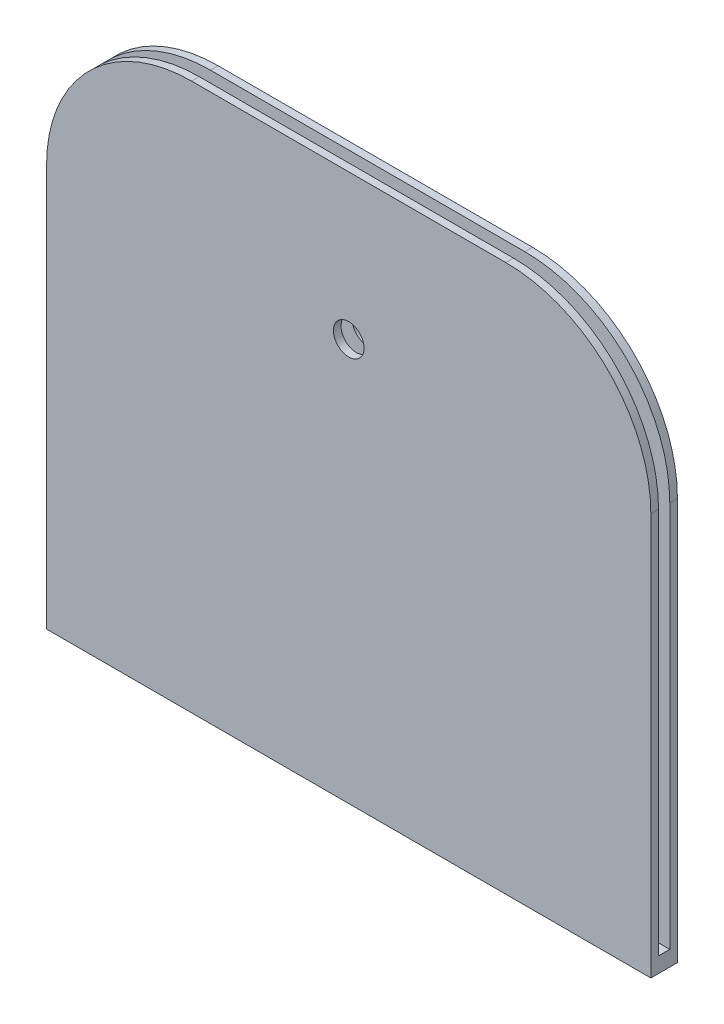
ISO-10303-21;
HEADER;
FILE_DESCRIPTION(('STEP AP214'),'2;1');
FILE_NAME('part.step','',(''),(''),'','','');
FILE_SCHEMA(('AUTOMOTIVE_DESIGN { 1 0 10303 214 1 1 1 1 }'));
ENDSEC;
DATA;
#1=APPLICATION_CONTEXT('core data for automotive mechanical design processes');
#2=APPLICATION_PROTOCOL_DEFINITION('international standard','automotive_design',2000,#1);
#3=PRODUCT_CONTEXT('',#1,'mechanical');
#4=PRODUCT('Part','Part','',(#3));
#5=PRODUCT_RELATED_PRODUCT_CATEGORY('part','',(#4));
#6=PRODUCT_DEFINITION_FORMATION('','',#4);
#7=PRODUCT_DEFINITION_CONTEXT('part definition',#1,'design');
#8=PRODUCT_DEFINITION('design','',#6,#7);
#9=PRODUCT_DEFINITION_SHAPE('','',#8);
#10=(LENGTH_UNIT() NAMED_UNIT(*) SI_UNIT(.MILLI.,.METRE.));
#11=(NAMED_UNIT(*) PLANE_ANGLE_UNIT() SI_UNIT($,.RADIAN.));
#12=(NAMED_UNIT(*) SI_UNIT($,.STERADIAN.) SOLID_ANGLE_UNIT());
#13=UNCERTAINTY_MEASURE_WITH_UNIT(LENGTH_MEASURE(1.E-05),#10,'distance_accuracy_value','');
#14=(GEOMETRIC_REPRESENTATION_CONTEXT(3) GLOBAL_UNCERTAINTY_ASSIGNED_CONTEXT((#13)) GLOBAL_UNIT_ASSIGNED_CONTEXT((#10,
#11,#12)) REPRESENTATION_CONTEXT('',''));
#15=CARTESIAN_POINT('',(0.,0.,0.));
#16=DIRECTION('',(0.,0.,1.));
#17=DIRECTION('',(1.,0.,0.));
#18=AXIS2_PLACEMENT_3D('',#15,#16,#17);
#19=CARTESIAN_POINT('',(0.,6.35,0.));
#20=DIRECTION('',(0.,1.,0.));
#21=DIRECTION('',(0.,0.,1.));
#22=AXIS2_PLACEMENT_3D('',#19,#20,#21);
#23=PLANE('',#22);
#24=DIRECTION('',(0.,0.,1.));
#25=VECTOR('',#24,1.);
#26=CARTESIAN_POINT('',(0.,6.35,-5.19119685893226));
#27=LINE('',#26,#25);
#28=CARTESIAN_POINT('',(0.,6.35,-2.01619685893224));
#29=VERTEX_POINT('',#28);
#30=CARTESIAN_POINT('',(0.,6.35,2.63380314106774));
#31=VERTEX_POINT('',#30);
#32=EDGE_CURVE('E128',#29,#31,#27,.T.);
#33=ORIENTED_EDGE('',*,*,#32,.T.);
#34=DIRECTION('',(-1.,0.,0.));
#35=VECTOR('',#34,1.);
#36=CARTESIAN_POINT('',(0.,6.35,2.63380314106774));
#37=LINE('',#36,#35);
#38=CARTESIAN_POINT('',(250.,6.35,2.63380314106774));
#39=VERTEX_POINT('',#38);
#40=EDGE_CURVE('E137',#39,#31,#37,.T.);
#41=ORIENTED_EDGE('',*,*,#40,.F.);
#42=DIRECTION('',(0.,0.,-1.));
#43=VECTOR('',#42,1.);
#44=CARTESIAN_POINT('',(250.,6.35,-5.19119685893226));
#45=LINE('',#44,#43);
#46=CARTESIAN_POINT('',(250.,6.35,-2.01619685893226));
#47=VERTEX_POINT('',#46);
#48=EDGE_CURVE('E150',#39,#47,#45,.T.);
#49=ORIENTED_EDGE('',*,*,#48,.T.);
#50=DIRECTION('',(1.,0.,0.));
#51=VECTOR('',#50,1.);
#52=CARTESIAN_POINT('',(250.,6.35,-2.01619685893226));
#53=LINE('',#52,#51);
#54=EDGE_CURVE('E149',#29,#47,#53,.T.);
#55=ORIENTED_EDGE('',*,*,#54,.F.);
#56=EDGE_LOOP('',(#33,#41,#49,#55));
#57=FACE_BOUND('',#56,.T.);
#58=ADVANCED_FACE('F37',(#57),#23,.T.);
#59=CARTESIAN_POINT('',(0.,6.35,-5.19119685893226));
#60=DIRECTION('',(1.,0.,0.));
#61=DIRECTION('',(0.,0.,-1.));
#62=AXIS2_PLACEMENT_3D('',#59,#60,#61);
#63=PLANE('',#62);
#64=DIRECTION('',(0.,-1.,0.));
#65=VECTOR('',#64,1.);
#66=CARTESIAN_POINT('',(0.,226.35,-2.01619685893223));
#67=LINE('',#66,#65);
#68=CARTESIAN_POINT('',(0.,166.35,-2.01619685893223));
#69=VERTEX_POINT('',#68);
#70=EDGE_CURVE('E159',#69,#29,#67,.T.);
#71=ORIENTED_EDGE('',*,*,#70,.F.);
#72=DIRECTION('',(0.,0.,1.));
#73=VECTOR('',#72,1.);
#74=CARTESIAN_POINT('',(0.,166.35,-5.19119685893226));
#75=LINE('',#74,#73);
#76=CARTESIAN_POINT('',(0.,166.35,-5.19119685893226));
#77=VERTEX_POINT('',#76);
#78=EDGE_CURVE('E11',#69,#77,#75,.F.);
#79=ORIENTED_EDGE('',*,*,#78,.T.);
#80=DIRECTION('',(0.,-1.,0.));
#81=VECTOR('',#80,1.);
#82=CARTESIAN_POINT('',(0.,6.35,-5.19119685893226));
#83=LINE('',#82,#81);
#84=CARTESIAN_POINT('',(0.,0.,-5.19119685893226));
#85=VERTEX_POINT('',#84);
#86=EDGE_CURVE('E153',#77,#85,#83,.T.);
#87=ORIENTED_EDGE('',*,*,#86,.T.);
#88=DIRECTION('',(0.,0.,1.));
#89=VECTOR('',#88,1.);
#90=CARTESIAN_POINT('',(0.,0.,-5.19119685893226));
#91=LINE('',#90,#89);
#92=CARTESIAN_POINT('',(0.,0.,5.80880314106774));
#93=VERTEX_POINT('',#92);
#94=EDGE_CURVE('E162',#85,#93,#91,.T.);
#95=ORIENTED_EDGE('',*,*,#94,.T.);
#96=DIRECTION('',(0.,-1.,0.));
#97=VECTOR('',#96,1.);
#98=CARTESIAN_POINT('',(0.,6.35,5.80880314106774));
#99=LINE('',#98,#97);
#100=CARTESIAN_POINT('',(0.,166.35,5.80880314106774));
#101=VERTEX_POINT('',#100);
#102=EDGE_CURVE('E175',#101,#93,#99,.T.);
#103=ORIENTED_EDGE('',*,*,#102,.F.);
#104=DIRECTION('',(0.,0.,1.));
#105=VECTOR('',#104,1.);
#106=CARTESIAN_POINT('',(0.,166.35,-5.19119685893226));
#107=LINE('',#106,#105);
#108=CARTESIAN_POINT('',(0.,166.35,2.63380314106774));
#109=VERTEX_POINT('',#108);
#110=EDGE_CURVE('E46',#101,#109,#107,.F.);
#111=ORIENTED_EDGE('',*,*,#110,.T.);
#112=DIRECTION('',(0.,-1.,0.));
#113=VECTOR('',#112,1.);
#114=CARTESIAN_POINT('',(0.,226.35,2.63380314106774));
#115=LINE('',#114,#113);
#116=EDGE_CURVE('E124',#109,#31,#115,.T.);
#117=ORIENTED_EDGE('',*,*,#116,.T.);
#118=ORIENTED_EDGE('',*,*,#32,.F.);
#119=EDGE_LOOP('',(#71,#79,#87,#95,#103,#111,#117,#118));
#120=FACE_BOUND('',#119,.T.);
#121=ADVANCED_FACE('F126',(#120),#63,.F.);
#122=CARTESIAN_POINT('',(0.,6.35,5.80880314106774));
#123=DIRECTION('',(0.,0.,-1.));
#124=DIRECTION('',(-1.,0.,0.));
#125=AXIS2_PLACEMENT_3D('',#122,#123,#124);
#126=PLANE('',#125);
#127=CARTESIAN_POINT('',(125.,166.35,5.80880314106774));
#128=DIRECTION('',(0.,0.,-1.));
#129=DIRECTION('',(-1.,0.,0.));
#130=AXIS2_PLACEMENT_3D('',#127,#128,#129);
#131=CIRCLE('',#130,6.34999999999999);
#132=CARTESIAN_POINT('',(118.65,166.35,5.80880314106774));
#133=VERTEX_POINT('',#132);
#134=EDGE_CURVE('E293',#133,#133,#131,.F.);
#135=ORIENTED_EDGE('',*,*,#134,.F.);
#136=EDGE_LOOP('',(#135));
#137=FACE_BOUND('',#136,.T.);
#138=DIRECTION('',(0.,-1.,0.));
#139=VECTOR('',#138,1.);
#140=CARTESIAN_POINT('',(250.,6.35,5.80880314106774));
#141=LINE('',#140,#139);
#142=CARTESIAN_POINT('',(250.,166.35,5.80880314106774));
#143=VERTEX_POINT('',#142);
#144=CARTESIAN_POINT('',(250.,0.,5.80880314106774));
#145=VERTEX_POINT('',#144);
#146=EDGE_CURVE('E173',#143,#145,#141,.T.);
#147=ORIENTED_EDGE('',*,*,#146,.F.);
#148=CARTESIAN_POINT('',(190.,166.35,5.80880314106774));
#149=DIRECTION('',(0.,0.,-1.));
#150=DIRECTION('',(-1.,0.,0.));
#151=AXIS2_PLACEMENT_3D('',#148,#149,#150);
#152=CIRCLE('',#151,60.);
#153=CARTESIAN_POINT('',(190.,226.35,5.80880314106774));
#154=VERTEX_POINT('',#153);
#155=EDGE_CURVE('E193',#143,#154,#152,.F.);
#156=ORIENTED_EDGE('',*,*,#155,.T.);
#157=DIRECTION('',(1.,0.,0.));
#158=VECTOR('',#157,1.);
#159=CARTESIAN_POINT('',(0.,226.35,5.80880314106774));
#160=LINE('',#159,#158);
#161=CARTESIAN_POINT('',(60.,226.35,5.80880314106774));
#162=VERTEX_POINT('',#161);
#163=EDGE_CURVE('E144',#162,#154,#160,.T.);
#164=ORIENTED_EDGE('',*,*,#163,.F.);
#165=CARTESIAN_POINT('',(60.,166.35,5.80880314106774));
#166=DIRECTION('',(0.,0.,-1.));
#167=DIRECTION('',(-1.,0.,0.));
#168=AXIS2_PLACEMENT_3D('',#165,#166,#167);
#169=CIRCLE('',#168,60.);
#170=EDGE_CURVE('E191',#162,#101,#169,.F.);
#171=ORIENTED_EDGE('',*,*,#170,.T.);
#172=ORIENTED_EDGE('',*,*,#102,.T.);
#173=DIRECTION('',(1.,0.,0.));
#174=VECTOR('',#173,1.);
#175=CARTESIAN_POINT('',(0.,0.,5.80880314106774));
#176=LINE('',#175,#174);
#177=EDGE_CURVE('E165',#93,#145,#176,.T.);
#178=ORIENTED_EDGE('',*,*,#177,.T.);
#179=EDGE_LOOP('',(#147,#156,#164,#171,#172,#178));
#180=FACE_BOUND('',#179,.T.);
#181=ADVANCED_FACE('F254',(#137,#180),#126,.F.);
#182=CARTESIAN_POINT('',(250.,6.35,-5.19119685893226));
#183=DIRECTION('',(-1.,0.,0.));
#184=DIRECTION('',(0.,0.,1.));
#185=AXIS2_PLACEMENT_3D('',#182,#183,#184);
#186=PLANE('',#185);
#187=DIRECTION('',(0.,-1.,0.));
#188=VECTOR('',#187,1.);
#189=CARTESIAN_POINT('',(250.,226.35,2.63380314106774));
#190=LINE('',#189,#188);
#191=CARTESIAN_POINT('',(250.,166.35,2.63380314106774));
#192=VERTEX_POINT('',#191);
#193=EDGE_CURVE('E133',#192,#39,#190,.T.);
#194=ORIENTED_EDGE('',*,*,#193,.F.);
#195=DIRECTION('',(0.,0.,-1.));
#196=VECTOR('',#195,1.);
#197=CARTESIAN_POINT('',(250.,166.35,-5.19119685893226));
#198=LINE('',#197,#196);
#199=EDGE_CURVE('E189',#192,#143,#198,.F.);
#200=ORIENTED_EDGE('',*,*,#199,.T.);
#201=ORIENTED_EDGE('',*,*,#146,.T.);
#202=DIRECTION('',(0.,0.,-1.));
#203=VECTOR('',#202,1.);
#204=CARTESIAN_POINT('',(250.,0.,-5.19119685893226));
#205=LINE('',#204,#203);
#206=CARTESIAN_POINT('',(250.,0.,-5.19119685893226));
#207=VERTEX_POINT('',#206);
#208=EDGE_CURVE('E156',#145,#207,#205,.T.);
#209=ORIENTED_EDGE('',*,*,#208,.T.);
#210=DIRECTION('',(0.,-1.,0.));
#211=VECTOR('',#210,1.);
#212=CARTESIAN_POINT('',(250.,6.35,-5.19119685893226));
#213=LINE('',#212,#211);
#214=CARTESIAN_POINT('',(250.,166.35,-5.19119685893226));
#215=VERTEX_POINT('',#214);
#216=EDGE_CURVE('E171',#215,#207,#213,.T.);
#217=ORIENTED_EDGE('',*,*,#216,.F.);
#218=DIRECTION('',(0.,0.,-1.));
#219=VECTOR('',#218,1.);
#220=CARTESIAN_POINT('',(250.,166.35,-5.19119685893226));
#221=LINE('',#220,#219);
#222=CARTESIAN_POINT('',(250.,166.35,-2.01619685893226));
#223=VERTEX_POINT('',#222);
#224=EDGE_CURVE('E187',#215,#223,#221,.F.);
#225=ORIENTED_EDGE('',*,*,#224,.T.);
#226=DIRECTION('',(0.,-1.,0.));
#227=VECTOR('',#226,1.);
#228=CARTESIAN_POINT('',(250.,226.35,-2.01619685893226));
#229=LINE('',#228,#227);
#230=EDGE_CURVE('E213',#223,#47,#229,.T.);
#231=ORIENTED_EDGE('',*,*,#230,.T.);
#232=ORIENTED_EDGE('',*,*,#48,.F.);
#233=EDGE_LOOP('',(#194,#200,#201,#209,#217,#225,#231,#232));
#234=FACE_BOUND('',#233,.T.);
#235=ADVANCED_FACE('F229',(#234),#186,.F.);
#236=CARTESIAN_POINT('',(0.,6.35,-5.19119685893226));
#237=DIRECTION('',(0.,0.,1.));
#238=DIRECTION('',(1.,0.,0.));
#239=AXIS2_PLACEMENT_3D('',#236,#237,#238);
#240=PLANE('',#239);
#241=CARTESIAN_POINT('',(125.,166.35,-5.19119685893226));
#242=DIRECTION('',(0.,0.,-1.));
#243=DIRECTION('',(-1.,0.,0.));
#244=AXIS2_PLACEMENT_3D('',#241,#242,#243);
#245=CIRCLE('',#244,6.34999999999999);
#246=CARTESIAN_POINT('',(118.65,166.35,-5.19119685893226));
#247=VERTEX_POINT('',#246);
#248=EDGE_CURVE('E296',#247,#247,#245,.T.);
#249=ORIENTED_EDGE('',*,*,#248,.F.);
#250=EDGE_LOOP('',(#249));
#251=FACE_BOUND('',#250,.T.);
#252=DIRECTION('',(-1.,0.,0.));
#253=VECTOR('',#252,1.);
#254=CARTESIAN_POINT('',(250.,226.35,-5.19119685893226));
#255=LINE('',#254,#253);
#256=CARTESIAN_POINT('',(190.,226.35,-5.19119685893226));
#257=VERTEX_POINT('',#256);
#258=CARTESIAN_POINT('',(60.,226.35,-5.19119685893226));
#259=VERTEX_POINT('',#258);
#260=EDGE_CURVE('E222',#257,#259,#255,.T.);
#261=ORIENTED_EDGE('',*,*,#260,.F.);
#262=CARTESIAN_POINT('',(190.,166.35,-5.19119685893226));
#263=DIRECTION('',(0.,0.,1.));
#264=DIRECTION('',(1.,0.,0.));
#265=AXIS2_PLACEMENT_3D('',#262,#263,#264);
#266=CIRCLE('',#265,60.);
#267=EDGE_CURVE('E203',#257,#215,#266,.F.);
#268=ORIENTED_EDGE('',*,*,#267,.T.);
#269=ORIENTED_EDGE('',*,*,#216,.T.);
#270=DIRECTION('',(-1.,0.,0.));
#271=VECTOR('',#270,1.);
#272=CARTESIAN_POINT('',(0.,0.,-5.19119685893226));
#273=LINE('',#272,#271);
#274=EDGE_CURVE('E151',#207,#85,#273,.T.);
#275=ORIENTED_EDGE('',*,*,#274,.T.);
#276=ORIENTED_EDGE('',*,*,#86,.F.);
#277=CARTESIAN_POINT('',(60.,166.35,-5.19119685893226));
#278=DIRECTION('',(0.,0.,1.));
#279=DIRECTION('',(1.,0.,0.));
#280=AXIS2_PLACEMENT_3D('',#277,#278,#279);
#281=CIRCLE('',#280,60.);
#282=EDGE_CURVE('E201',#77,#259,#281,.F.);
#283=ORIENTED_EDGE('',*,*,#282,.T.);
#284=EDGE_LOOP('',(#261,#268,#269,#275,#276,#283));
#285=FACE_BOUND('',#284,.T.);
#286=ADVANCED_FACE('F227',(#251,#285),#240,.F.);
#287=CARTESIAN_POINT('',(0.,0.,0.));
#288=DIRECTION('',(0.,1.,0.));
#289=DIRECTION('',(0.,0.,1.));
#290=AXIS2_PLACEMENT_3D('',#287,#288,#289);
#291=PLANE('',#290);
#292=ORIENTED_EDGE('',*,*,#94,.F.);
#293=ORIENTED_EDGE('',*,*,#274,.F.);
#294=ORIENTED_EDGE('',*,*,#208,.F.);
#295=ORIENTED_EDGE('',*,*,#177,.F.);
#296=EDGE_LOOP('',(#292,#293,#294,#295));
#297=FACE_BOUND('',#296,.T.);
#298=ADVANCED_FACE('F236',(#297),#291,.F.);
#299=CARTESIAN_POINT('',(250.,226.35,-2.01619685893226));
#300=DIRECTION('',(0.,0.,-1.));
#301=DIRECTION('',(-1.,0.,0.));
#302=AXIS2_PLACEMENT_3D('',#299,#300,#301);
#303=PLANE('',#302);
#304=CARTESIAN_POINT('',(125.,166.35,-2.01619685893224));
#305=DIRECTION('',(0.,0.,-1.));
#306=DIRECTION('',(-1.,0.,0.));
#307=AXIS2_PLACEMENT_3D('',#304,#305,#306);
#308=CIRCLE('',#307,6.34999999999999);
#309=CARTESIAN_POINT('',(118.65,166.35,-2.01619685893224));
#310=VERTEX_POINT('',#309);
#311=EDGE_CURVE('E145',#310,#310,#308,.T.);
#312=ORIENTED_EDGE('',*,*,#311,.T.);
#313=EDGE_LOOP('',(#312));
#314=FACE_BOUND('',#313,.T.);
#315=ORIENTED_EDGE('',*,*,#230,.F.);
#316=CARTESIAN_POINT('',(190.,166.35,-2.01619685893225));
#317=DIRECTION('',(0.,0.,-1.));
#318=DIRECTION('',(-1.,0.,0.));
#319=AXIS2_PLACEMENT_3D('',#316,#317,#318);
#320=CIRCLE('',#319,60.);
#321=CARTESIAN_POINT('',(190.,226.35,-2.01619685893225));
#322=VERTEX_POINT('',#321);
#323=EDGE_CURVE('E206',#223,#322,#320,.F.);
#324=ORIENTED_EDGE('',*,*,#323,.T.);
#325=DIRECTION('',(1.,0.,0.));
#326=VECTOR('',#325,1.);
#327=CARTESIAN_POINT('',(250.,226.35,-2.01619685893226));
#328=LINE('',#327,#326);
#329=CARTESIAN_POINT('',(60.,226.35,-2.01619685893223));
#330=VERTEX_POINT('',#329);
#331=EDGE_CURVE('E212',#330,#322,#328,.T.);
#332=ORIENTED_EDGE('',*,*,#331,.F.);
#333=CARTESIAN_POINT('',(60.,166.35,-2.01619685893223));
#334=DIRECTION('',(0.,0.,-1.));
#335=DIRECTION('',(-1.,0.,0.));
#336=AXIS2_PLACEMENT_3D('',#333,#334,#335);
#337=CIRCLE('',#336,60.);
#338=EDGE_CURVE('E53',#330,#69,#337,.F.);
#339=ORIENTED_EDGE('',*,*,#338,.T.);
#340=ORIENTED_EDGE('',*,*,#70,.T.);
#341=ORIENTED_EDGE('',*,*,#54,.T.);
#342=EDGE_LOOP('',(#315,#324,#332,#339,#340,#341));
#343=FACE_BOUND('',#342,.T.);
#344=ADVANCED_FACE('F211',(#314,#343),#303,.F.);
#345=CARTESIAN_POINT('',(0.,226.35,0.));
#346=DIRECTION('',(0.,-1.,0.));
#347=DIRECTION('',(0.,0.,-1.));
#348=AXIS2_PLACEMENT_3D('',#345,#346,#347);
#349=PLANE('',#348);
#350=ORIENTED_EDGE('',*,*,#331,.T.);
#351=DIRECTION('',(0.,0.,-1.));
#352=VECTOR('',#351,1.);
#353=CARTESIAN_POINT('',(190.,226.35,-4.79414487906317E-13));
#354=LINE('',#353,#352);
#355=EDGE_CURVE('E198',#322,#257,#354,.T.);
#356=ORIENTED_EDGE('',*,*,#355,.T.);
#357=ORIENTED_EDGE('',*,*,#260,.T.);
#358=DIRECTION('',(0.,0.,1.));
#359=VECTOR('',#358,1.);
#360=CARTESIAN_POINT('',(60.,226.35,0.));
#361=LINE('',#360,#359);
#362=EDGE_CURVE('E195',#259,#330,#361,.T.);
#363=ORIENTED_EDGE('',*,*,#362,.T.);
#364=EDGE_LOOP('',(#350,#356,#357,#363));
#365=FACE_BOUND('',#364,.T.);
#366=ADVANCED_FACE('F218',(#365),#349,.F.);
#367=CARTESIAN_POINT('',(0.,226.35,2.63380314106774));
#368=DIRECTION('',(0.,0.,1.));
#369=DIRECTION('',(1.,0.,0.));
#370=AXIS2_PLACEMENT_3D('',#367,#368,#369);
#371=PLANE('',#370);
#372=CARTESIAN_POINT('',(125.,166.35,2.63380314106774));
#373=DIRECTION('',(0.,0.,1.));
#374=DIRECTION('',(1.,0.,0.));
#375=AXIS2_PLACEMENT_3D('',#372,#373,#374);
#376=CIRCLE('',#375,6.34999999999999);
#377=CARTESIAN_POINT('',(131.35,166.35,2.63380314106774));
#378=VERTEX_POINT('',#377);
#379=EDGE_CURVE('E41',#378,#378,#376,.T.);
#380=ORIENTED_EDGE('',*,*,#379,.T.);
#381=EDGE_LOOP('',(#380));
#382=FACE_BOUND('',#381,.T.);
#383=DIRECTION('',(-1.,0.,0.));
#384=VECTOR('',#383,1.);
#385=CARTESIAN_POINT('',(0.,226.35,2.63380314106774));
#386=LINE('',#385,#384);
#387=CARTESIAN_POINT('',(190.,226.35,2.63380314106774));
#388=VERTEX_POINT('',#387);
#389=CARTESIAN_POINT('',(60.,226.35,2.63380314106774));
#390=VERTEX_POINT('',#389);
#391=EDGE_CURVE('E134',#388,#390,#386,.T.);
#392=ORIENTED_EDGE('',*,*,#391,.F.);
#393=CARTESIAN_POINT('',(190.,166.35,2.63380314106774));
#394=DIRECTION('',(0.,0.,1.));
#395=DIRECTION('',(1.,0.,0.));
#396=AXIS2_PLACEMENT_3D('',#393,#394,#395);
#397=CIRCLE('',#396,60.);
#398=EDGE_CURVE('E185',#388,#192,#397,.F.);
#399=ORIENTED_EDGE('',*,*,#398,.T.);
#400=ORIENTED_EDGE('',*,*,#193,.T.);
#401=ORIENTED_EDGE('',*,*,#40,.T.);
#402=ORIENTED_EDGE('',*,*,#116,.F.);
#403=CARTESIAN_POINT('',(60.,166.35,2.63380314106774));
#404=DIRECTION('',(0.,0.,1.));
#405=DIRECTION('',(1.,0.,0.));
#406=AXIS2_PLACEMENT_3D('',#403,#404,#405);
#407=CIRCLE('',#406,60.);
#408=EDGE_CURVE('E183',#109,#390,#407,.F.);
#409=ORIENTED_EDGE('',*,*,#408,.T.);
#410=EDGE_LOOP('',(#392,#399,#400,#401,#402,#409));
#411=FACE_BOUND('',#410,.T.);
#412=ADVANCED_FACE('F139',(#382,#411),#371,.F.);
#413=CARTESIAN_POINT('',(0.,226.35,0.));
#414=DIRECTION('',(0.,-1.,0.));
#415=DIRECTION('',(0.,0.,-1.));
#416=AXIS2_PLACEMENT_3D('',#413,#414,#415);
#417=PLANE('',#416);
#418=ORIENTED_EDGE('',*,*,#163,.T.);
#419=DIRECTION('',(0.,0.,-1.));
#420=VECTOR('',#419,1.);
#421=CARTESIAN_POINT('',(190.,226.35,-4.79414487906317E-13));
#422=LINE('',#421,#420);
#423=EDGE_CURVE('E180',#154,#388,#422,.T.);
#424=ORIENTED_EDGE('',*,*,#423,.T.);
#425=ORIENTED_EDGE('',*,*,#391,.T.);
#426=DIRECTION('',(0.,0.,1.));
#427=VECTOR('',#426,1.);
#428=CARTESIAN_POINT('',(60.,226.35,0.));
#429=LINE('',#428,#427);
#430=EDGE_CURVE('E177',#390,#162,#429,.T.);
#431=ORIENTED_EDGE('',*,*,#430,.T.);
#432=EDGE_LOOP('',(#418,#424,#425,#431));
#433=FACE_BOUND('',#432,.T.);
#434=ADVANCED_FACE('F270',(#433),#417,.F.);
#435=CARTESIAN_POINT('',(190.,166.35,-4.79414487906317E-13));
#436=DIRECTION('',(0.,0.,-1.));
#437=DIRECTION('',(-1.,0.,0.));
#438=AXIS2_PLACEMENT_3D('',#435,#436,#437);
#439=CYLINDRICAL_SURFACE('',#438,60.);
#440=ORIENTED_EDGE('',*,*,#155,.F.);
#441=ORIENTED_EDGE('',*,*,#199,.F.);
#442=ORIENTED_EDGE('',*,*,#398,.F.);
#443=ORIENTED_EDGE('',*,*,#423,.F.);
#444=EDGE_LOOP('',(#440,#441,#442,#443));
#445=FACE_BOUND('',#444,.T.);
#446=ADVANCED_FACE('F247',(#445),#439,.T.);
#447=CARTESIAN_POINT('',(190.,166.35,-4.79414487906317E-13));
#448=DIRECTION('',(0.,0.,-1.));
#449=DIRECTION('',(-1.,0.,0.));
#450=AXIS2_PLACEMENT_3D('',#447,#448,#449);
#451=CYLINDRICAL_SURFACE('',#450,60.);
#452=ORIENTED_EDGE('',*,*,#323,.F.);
#453=ORIENTED_EDGE('',*,*,#224,.F.);
#454=ORIENTED_EDGE('',*,*,#267,.F.);
#455=ORIENTED_EDGE('',*,*,#355,.F.);
#456=EDGE_LOOP('',(#452,#453,#454,#455));
#457=FACE_BOUND('',#456,.T.);
#458=ADVANCED_FACE('F224',(#457),#451,.T.);
#459=CARTESIAN_POINT('',(60.,166.35,0.));
#460=DIRECTION('',(0.,0.,1.));
#461=DIRECTION('',(1.,0.,0.));
#462=AXIS2_PLACEMENT_3D('',#459,#460,#461);
#463=CYLINDRICAL_SURFACE('',#462,60.);
#464=ORIENTED_EDGE('',*,*,#282,.F.);
#465=ORIENTED_EDGE('',*,*,#78,.F.);
#466=ORIENTED_EDGE('',*,*,#338,.F.);
#467=ORIENTED_EDGE('',*,*,#362,.F.);
#468=EDGE_LOOP('',(#464,#465,#466,#467));
#469=FACE_BOUND('',#468,.T.);
#470=ADVANCED_FACE('F239',(#469),#463,.T.);
#471=CARTESIAN_POINT('',(60.,166.35,0.));
#472=DIRECTION('',(0.,0.,1.));
#473=DIRECTION('',(1.,0.,0.));
#474=AXIS2_PLACEMENT_3D('',#471,#472,#473);
#475=CYLINDRICAL_SURFACE('',#474,60.);
#476=ORIENTED_EDGE('',*,*,#408,.F.);
#477=ORIENTED_EDGE('',*,*,#110,.F.);
#478=ORIENTED_EDGE('',*,*,#170,.F.);
#479=ORIENTED_EDGE('',*,*,#430,.F.);
#480=EDGE_LOOP('',(#476,#477,#478,#479));
#481=FACE_BOUND('',#480,.T.);
#482=ADVANCED_FACE('F39',(#481),#475,.T.);
#483=CARTESIAN_POINT('',(125.,166.35,23.769315383206));
#484=DIRECTION('',(0.,0.,-1.));
#485=DIRECTION('',(-1.,0.,0.));
#486=AXIS2_PLACEMENT_3D('',#483,#484,#485);
#487=CYLINDRICAL_SURFACE('',#486,6.34999999999999);
#488=ORIENTED_EDGE('',*,*,#134,.T.);
#489=EDGE_LOOP('',(#488));
#490=FACE_BOUND('',#489,.T.);
#491=ORIENTED_EDGE('',*,*,#379,.F.);
#492=EDGE_LOOP('',(#491));
#493=FACE_BOUND('',#492,.T.);
#494=ADVANCED_FACE('F245',(#490,#493),#487,.F.);
#495=ORIENTED_EDGE('',*,*,#248,.T.);
#496=EDGE_LOOP('',(#495));
#497=FACE_BOUND('',#496,.T.);
#498=ORIENTED_EDGE('',*,*,#311,.F.);
#499=EDGE_LOOP('',(#498));
#500=FACE_BOUND('',#499,.T.);
#501=ADVANCED_FACE('F300',(#497,#500),#487,.F.);
#502=CLOSED_SHELL('',(#58,#121,#181,#235,#286,#298,#344,#366,#412,#434,#446,#458,#470,#482,#494,#501));
#503=MANIFOLD_SOLID_BREP('B2',#502);
#504=ADVANCED_BREP_SHAPE_REPRESENTATION('',(#18,#503),#14);
#505=SHAPE_DEFINITION_REPRESENTATION(#9,#504);
ENDSEC;
END-ISO-10303-21;
